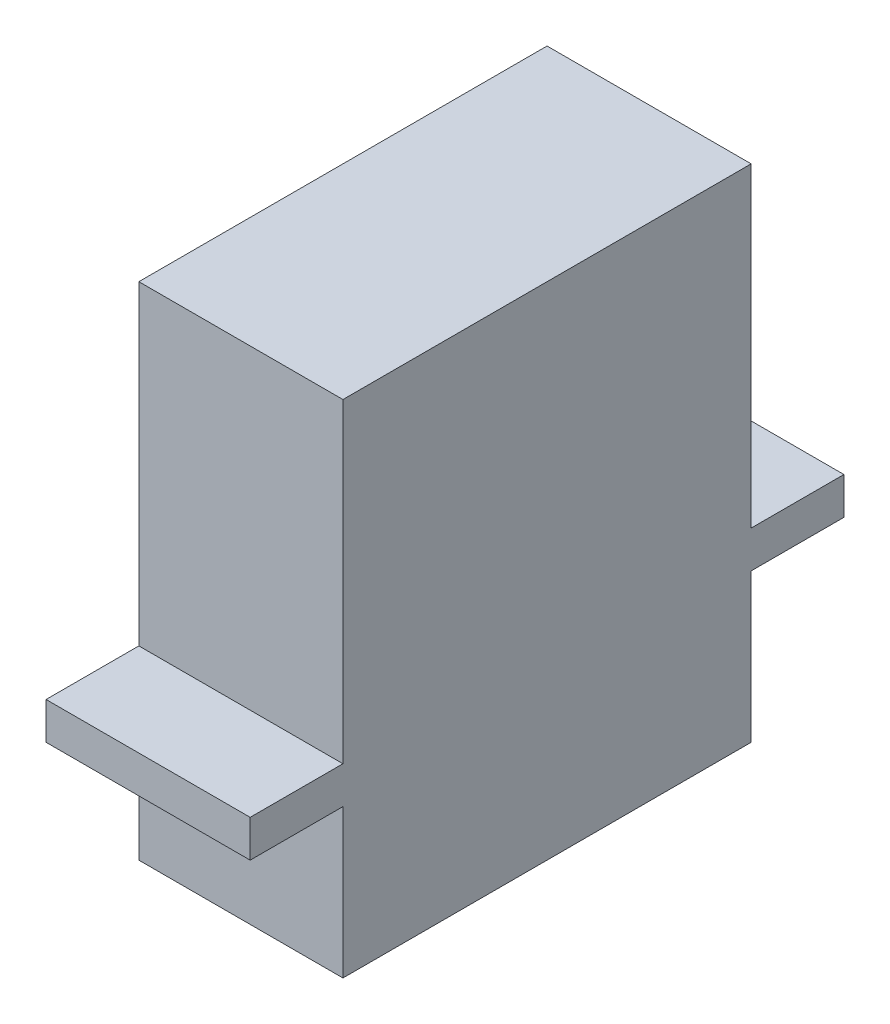
ISO-10303-21;
HEADER;
FILE_DESCRIPTION(('STEP AP214'),'2;1');
FILE_NAME('part.step','',(''),(''),'','','');
FILE_SCHEMA(('AUTOMOTIVE_DESIGN { 1 0 10303 214 1 1 1 1 }'));
ENDSEC;
DATA;
#1=APPLICATION_CONTEXT('core data for automotive mechanical design processes');
#2=APPLICATION_PROTOCOL_DEFINITION('international standard','automotive_design',2000,#1);
#3=PRODUCT_CONTEXT('',#1,'mechanical');
#4=PRODUCT('Part','Part','',(#3));
#5=PRODUCT_RELATED_PRODUCT_CATEGORY('part','',(#4));
#6=PRODUCT_DEFINITION_FORMATION('','',#4);
#7=PRODUCT_DEFINITION_CONTEXT('part definition',#1,'design');
#8=PRODUCT_DEFINITION('design','',#6,#7);
#9=PRODUCT_DEFINITION_SHAPE('','',#8);
#10=(LENGTH_UNIT() NAMED_UNIT(*) SI_UNIT(.MILLI.,.METRE.));
#11=(NAMED_UNIT(*) PLANE_ANGLE_UNIT() SI_UNIT($,.RADIAN.));
#12=(NAMED_UNIT(*) SI_UNIT($,.STERADIAN.) SOLID_ANGLE_UNIT());
#13=UNCERTAINTY_MEASURE_WITH_UNIT(LENGTH_MEASURE(1.E-05),#10,'distance_accuracy_value','');
#14=(GEOMETRIC_REPRESENTATION_CONTEXT(3) GLOBAL_UNCERTAINTY_ASSIGNED_CONTEXT((#13)) GLOBAL_UNIT_ASSIGNED_CONTEXT((#10,
#11,#12)) REPRESENTATION_CONTEXT('',''));
#15=CARTESIAN_POINT('',(0.,0.,0.));
#16=DIRECTION('',(0.,0.,1.));
#17=DIRECTION('',(1.,0.,0.));
#18=AXIS2_PLACEMENT_3D('',#15,#16,#17);
#19=CARTESIAN_POINT('',(0.,27.,-22.));
#20=DIRECTION('',(0.,0.,1.));
#21=DIRECTION('',(1.,0.,0.));
#22=AXIS2_PLACEMENT_3D('',#19,#20,#21);
#23=PLANE('',#22);
#24=DIRECTION('',(-1.,0.,0.));
#25=VECTOR('',#24,1.);
#26=CARTESIAN_POINT('',(0.,8.,-22.));
#27=LINE('',#26,#25);
#28=CARTESIAN_POINT('',(11.,8.,-22.));
#29=VERTEX_POINT('',#28);
#30=CARTESIAN_POINT('',(0.,8.,-22.));
#31=VERTEX_POINT('',#30);
#32=EDGE_CURVE('E148',#29,#31,#27,.T.);
#33=ORIENTED_EDGE('',*,*,#32,.F.);
#34=DIRECTION('',(0.,-1.,0.));
#35=VECTOR('',#34,1.);
#36=CARTESIAN_POINT('',(11.,27.,-22.));
#37=LINE('',#36,#35);
#38=CARTESIAN_POINT('',(11.,0.,-22.));
#39=VERTEX_POINT('',#38);
#40=EDGE_CURVE('E207',#29,#39,#37,.T.);
#41=ORIENTED_EDGE('',*,*,#40,.T.);
#42=DIRECTION('',(-1.,0.,0.));
#43=VECTOR('',#42,1.);
#44=CARTESIAN_POINT('',(0.,0.,-22.));
#45=LINE('',#44,#43);
#46=CARTESIAN_POINT('',(0.,0.,-22.));
#47=VERTEX_POINT('',#46);
#48=EDGE_CURVE('E190',#39,#47,#45,.T.);
#49=ORIENTED_EDGE('',*,*,#48,.T.);
#50=DIRECTION('',(0.,-1.,0.));
#51=VECTOR('',#50,1.);
#52=CARTESIAN_POINT('',(0.,27.,-22.));
#53=LINE('',#52,#51);
#54=EDGE_CURVE('E196',#31,#47,#53,.T.);
#55=ORIENTED_EDGE('',*,*,#54,.F.);
#56=EDGE_LOOP('',(#33,#41,#49,#55));
#57=FACE_BOUND('',#56,.T.);
#58=ADVANCED_FACE('F37',(#57),#23,.F.);
#59=CARTESIAN_POINT('',(0.,27.,0.));
#60=DIRECTION('',(0.,0.,-1.));
#61=DIRECTION('',(-1.,0.,0.));
#62=AXIS2_PLACEMENT_3D('',#59,#60,#61);
#63=PLANE('',#62);
#64=DIRECTION('',(1.,0.,0.));
#65=VECTOR('',#64,1.);
#66=CARTESIAN_POINT('',(0.,8.,0.));
#67=LINE('',#66,#65);
#68=CARTESIAN_POINT('',(0.,8.,0.));
#69=VERTEX_POINT('',#68);
#70=CARTESIAN_POINT('',(11.,8.,0.));
#71=VERTEX_POINT('',#70);
#72=EDGE_CURVE('E174',#69,#71,#67,.T.);
#73=ORIENTED_EDGE('',*,*,#72,.F.);
#74=DIRECTION('',(0.,-1.,0.));
#75=VECTOR('',#74,1.);
#76=CARTESIAN_POINT('',(0.,27.,0.));
#77=LINE('',#76,#75);
#78=CARTESIAN_POINT('',(0.,0.,0.));
#79=VERTEX_POINT('',#78);
#80=EDGE_CURVE('E45',#69,#79,#77,.T.);
#81=ORIENTED_EDGE('',*,*,#80,.T.);
#82=DIRECTION('',(1.,0.,0.));
#83=VECTOR('',#82,1.);
#84=CARTESIAN_POINT('',(0.,0.,0.));
#85=LINE('',#84,#83);
#86=CARTESIAN_POINT('',(11.,0.,0.));
#87=VERTEX_POINT('',#86);
#88=EDGE_CURVE('E198',#79,#87,#85,.T.);
#89=ORIENTED_EDGE('',*,*,#88,.T.);
#90=DIRECTION('',(0.,-1.,0.));
#91=VECTOR('',#90,1.);
#92=CARTESIAN_POINT('',(11.,27.,0.));
#93=LINE('',#92,#91);
#94=EDGE_CURVE('E210',#71,#87,#93,.T.);
#95=ORIENTED_EDGE('',*,*,#94,.F.);
#96=EDGE_LOOP('',(#73,#81,#89,#95));
#97=FACE_BOUND('',#96,.T.);
#98=ADVANCED_FACE('F224',(#97),#63,.F.);
#99=CARTESIAN_POINT('',(0.,27.,0.));
#100=DIRECTION('',(1.,0.,0.));
#101=DIRECTION('',(0.,0.,-1.));
#102=AXIS2_PLACEMENT_3D('',#99,#100,#101);
#103=PLANE('',#102);
#104=DIRECTION('',(0.,0.,1.));
#105=VECTOR('',#104,1.);
#106=CARTESIAN_POINT('',(0.,0.,0.));
#107=LINE('',#106,#105);
#108=EDGE_CURVE('E184',#47,#79,#107,.T.);
#109=ORIENTED_EDGE('',*,*,#108,.T.);
#110=ORIENTED_EDGE('',*,*,#80,.F.);
#111=DIRECTION('',(0.,0.,-1.));
#112=VECTOR('',#111,1.);
#113=CARTESIAN_POINT('',(0.,8.,0.));
#114=LINE('',#113,#112);
#115=CARTESIAN_POINT('',(0.,8.,5.));
#116=VERTEX_POINT('',#115);
#117=EDGE_CURVE('E160',#116,#69,#114,.T.);
#118=ORIENTED_EDGE('',*,*,#117,.F.);
#119=DIRECTION('',(0.,-1.,0.));
#120=VECTOR('',#119,1.);
#121=CARTESIAN_POINT('',(0.,10.,5.));
#122=LINE('',#121,#120);
#123=CARTESIAN_POINT('',(0.,10.,5.));
#124=VERTEX_POINT('',#123);
#125=EDGE_CURVE('E182',#124,#116,#122,.T.);
#126=ORIENTED_EDGE('',*,*,#125,.F.);
#127=DIRECTION('',(0.,0.,-1.));
#128=VECTOR('',#127,1.);
#129=CARTESIAN_POINT('',(0.,10.,0.));
#130=LINE('',#129,#128);
#131=CARTESIAN_POINT('',(0.,10.,0.));
#132=VERTEX_POINT('',#131);
#133=EDGE_CURVE('E162',#124,#132,#130,.T.);
#134=ORIENTED_EDGE('',*,*,#133,.T.);
#135=CARTESIAN_POINT('',(0.,27.,0.));
#136=VERTEX_POINT('',#135);
#137=EDGE_CURVE('E11',#136,#132,#77,.T.);
#138=ORIENTED_EDGE('',*,*,#137,.F.);
#139=DIRECTION('',(0.,0.,1.));
#140=VECTOR('',#139,1.);
#141=CARTESIAN_POINT('',(0.,27.,0.));
#142=LINE('',#141,#140);
#143=CARTESIAN_POINT('',(0.,27.,-22.));
#144=VERTEX_POINT('',#143);
#145=EDGE_CURVE('E186',#144,#136,#142,.T.);
#146=ORIENTED_EDGE('',*,*,#145,.F.);
#147=CARTESIAN_POINT('',(0.,10.,-22.));
#148=VERTEX_POINT('',#147);
#149=EDGE_CURVE('E147',#144,#148,#53,.T.);
#150=ORIENTED_EDGE('',*,*,#149,.T.);
#151=DIRECTION('',(0.,0.,-1.));
#152=VECTOR('',#151,1.);
#153=CARTESIAN_POINT('',(0.,10.,-22.));
#154=LINE('',#153,#152);
#155=CARTESIAN_POINT('',(0.,10.,-27.));
#156=VERTEX_POINT('',#155);
#157=EDGE_CURVE('E52',#148,#156,#154,.T.);
#158=ORIENTED_EDGE('',*,*,#157,.T.);
#159=DIRECTION('',(0.,-1.,0.));
#160=VECTOR('',#159,1.);
#161=CARTESIAN_POINT('',(0.,10.,-27.));
#162=LINE('',#161,#160);
#163=CARTESIAN_POINT('',(0.,8.,-27.));
#164=VERTEX_POINT('',#163);
#165=EDGE_CURVE('E129',#156,#164,#162,.T.);
#166=ORIENTED_EDGE('',*,*,#165,.T.);
#167=DIRECTION('',(0.,0.,-1.));
#168=VECTOR('',#167,1.);
#169=CARTESIAN_POINT('',(0.,8.,-22.));
#170=LINE('',#169,#168);
#171=EDGE_CURVE('E156',#31,#164,#170,.T.);
#172=ORIENTED_EDGE('',*,*,#171,.F.);
#173=ORIENTED_EDGE('',*,*,#54,.T.);
#174=EDGE_LOOP('',(#109,#110,#118,#126,#134,#138,#146,#150,#158,#166,#172,#173));
#175=FACE_BOUND('',#174,.T.);
#176=ADVANCED_FACE('F39',(#175),#103,.F.);
#177=ORIENTED_EDGE('',*,*,#137,.T.);
#178=DIRECTION('',(1.,0.,0.));
#179=VECTOR('',#178,1.);
#180=CARTESIAN_POINT('',(0.,10.,0.));
#181=LINE('',#180,#179);
#182=CARTESIAN_POINT('',(11.,10.,0.));
#183=VERTEX_POINT('',#182);
#184=EDGE_CURVE('E165',#132,#183,#181,.T.);
#185=ORIENTED_EDGE('',*,*,#184,.T.);
#186=CARTESIAN_POINT('',(11.,27.,0.));
#187=VERTEX_POINT('',#186);
#188=EDGE_CURVE('E211',#187,#183,#93,.T.);
#189=ORIENTED_EDGE('',*,*,#188,.F.);
#190=DIRECTION('',(1.,0.,0.));
#191=VECTOR('',#190,1.);
#192=CARTESIAN_POINT('',(0.,27.,0.));
#193=LINE('',#192,#191);
#194=EDGE_CURVE('E189',#136,#187,#193,.T.);
#195=ORIENTED_EDGE('',*,*,#194,.F.);
#196=EDGE_LOOP('',(#177,#185,#189,#195));
#197=FACE_BOUND('',#196,.T.);
#198=ADVANCED_FACE('F245',(#197),#63,.F.);
#199=CARTESIAN_POINT('',(11.,27.,0.));
#200=DIRECTION('',(-1.,0.,0.));
#201=DIRECTION('',(0.,0.,1.));
#202=AXIS2_PLACEMENT_3D('',#199,#200,#201);
#203=PLANE('',#202);
#204=DIRECTION('',(0.,0.,-1.));
#205=VECTOR('',#204,1.);
#206=CARTESIAN_POINT('',(11.,0.,0.));
#207=LINE('',#206,#205);
#208=EDGE_CURVE('E201',#87,#39,#207,.T.);
#209=ORIENTED_EDGE('',*,*,#208,.T.);
#210=ORIENTED_EDGE('',*,*,#40,.F.);
#211=DIRECTION('',(0.,0.,1.));
#212=VECTOR('',#211,1.);
#213=CARTESIAN_POINT('',(11.,8.,-22.));
#214=LINE('',#213,#212);
#215=CARTESIAN_POINT('',(11.,8.,-27.));
#216=VERTEX_POINT('',#215);
#217=EDGE_CURVE('E151',#216,#29,#214,.T.);
#218=ORIENTED_EDGE('',*,*,#217,.F.);
#219=DIRECTION('',(0.,-1.,0.));
#220=VECTOR('',#219,1.);
#221=CARTESIAN_POINT('',(11.,10.,-27.));
#222=LINE('',#221,#220);
#223=CARTESIAN_POINT('',(11.,10.,-27.));
#224=VERTEX_POINT('',#223);
#225=EDGE_CURVE('E136',#224,#216,#222,.T.);
#226=ORIENTED_EDGE('',*,*,#225,.F.);
#227=DIRECTION('',(0.,0.,1.));
#228=VECTOR('',#227,1.);
#229=CARTESIAN_POINT('',(11.,10.,-22.));
#230=LINE('',#229,#228);
#231=CARTESIAN_POINT('',(11.,10.,-22.));
#232=VERTEX_POINT('',#231);
#233=EDGE_CURVE('E141',#224,#232,#230,.T.);
#234=ORIENTED_EDGE('',*,*,#233,.T.);
#235=CARTESIAN_POINT('',(11.,27.,-22.));
#236=VERTEX_POINT('',#235);
#237=EDGE_CURVE('E208',#236,#232,#37,.T.);
#238=ORIENTED_EDGE('',*,*,#237,.F.);
#239=DIRECTION('',(0.,0.,-1.));
#240=VECTOR('',#239,1.);
#241=CARTESIAN_POINT('',(11.,27.,0.));
#242=LINE('',#241,#240);
#243=EDGE_CURVE('E192',#187,#236,#242,.T.);
#244=ORIENTED_EDGE('',*,*,#243,.F.);
#245=ORIENTED_EDGE('',*,*,#188,.T.);
#246=DIRECTION('',(0.,0.,1.));
#247=VECTOR('',#246,1.);
#248=CARTESIAN_POINT('',(11.,10.,0.));
#249=LINE('',#248,#247);
#250=CARTESIAN_POINT('',(11.,10.,5.));
#251=VERTEX_POINT('',#250);
#252=EDGE_CURVE('E60',#183,#251,#249,.T.);
#253=ORIENTED_EDGE('',*,*,#252,.T.);
#254=DIRECTION('',(0.,-1.,0.));
#255=VECTOR('',#254,1.);
#256=CARTESIAN_POINT('',(11.,10.,5.));
#257=LINE('',#256,#255);
#258=CARTESIAN_POINT('',(11.,8.,5.));
#259=VERTEX_POINT('',#258);
#260=EDGE_CURVE('E172',#251,#259,#257,.T.);
#261=ORIENTED_EDGE('',*,*,#260,.T.);
#262=DIRECTION('',(0.,0.,1.));
#263=VECTOR('',#262,1.);
#264=CARTESIAN_POINT('',(11.,8.,0.));
#265=LINE('',#264,#263);
#266=EDGE_CURVE('E177',#71,#259,#265,.T.);
#267=ORIENTED_EDGE('',*,*,#266,.F.);
#268=ORIENTED_EDGE('',*,*,#94,.T.);
#269=EDGE_LOOP('',(#209,#210,#218,#226,#234,#238,#244,#245,#253,#261,#267,#268));
#270=FACE_BOUND('',#269,.T.);
#271=ADVANCED_FACE('F217',(#270),#203,.F.);
#272=ORIENTED_EDGE('',*,*,#237,.T.);
#273=DIRECTION('',(-1.,0.,0.));
#274=VECTOR('',#273,1.);
#275=CARTESIAN_POINT('',(0.,10.,-22.));
#276=LINE('',#275,#274);
#277=EDGE_CURVE('E137',#232,#148,#276,.T.);
#278=ORIENTED_EDGE('',*,*,#277,.T.);
#279=ORIENTED_EDGE('',*,*,#149,.F.);
#280=DIRECTION('',(-1.,0.,0.));
#281=VECTOR('',#280,1.);
#282=CARTESIAN_POINT('',(0.,27.,-22.));
#283=LINE('',#282,#281);
#284=EDGE_CURVE('E194',#236,#144,#283,.T.);
#285=ORIENTED_EDGE('',*,*,#284,.F.);
#286=EDGE_LOOP('',(#272,#278,#279,#285));
#287=FACE_BOUND('',#286,.T.);
#288=ADVANCED_FACE('F251',(#287),#23,.F.);
#289=CARTESIAN_POINT('',(0.,27.,0.));
#290=DIRECTION('',(0.,-1.,0.));
#291=DIRECTION('',(0.,0.,-1.));
#292=AXIS2_PLACEMENT_3D('',#289,#290,#291);
#293=PLANE('',#292);
#294=ORIENTED_EDGE('',*,*,#145,.T.);
#295=ORIENTED_EDGE('',*,*,#194,.T.);
#296=ORIENTED_EDGE('',*,*,#243,.T.);
#297=ORIENTED_EDGE('',*,*,#284,.T.);
#298=EDGE_LOOP('',(#294,#295,#296,#297));
#299=FACE_BOUND('',#298,.T.);
#300=ADVANCED_FACE('F247',(#299),#293,.F.);
#301=CARTESIAN_POINT('',(0.,0.,0.));
#302=DIRECTION('',(0.,-1.,0.));
#303=DIRECTION('',(0.,0.,-1.));
#304=AXIS2_PLACEMENT_3D('',#301,#302,#303);
#305=PLANE('',#304);
#306=ORIENTED_EDGE('',*,*,#108,.F.);
#307=ORIENTED_EDGE('',*,*,#48,.F.);
#308=ORIENTED_EDGE('',*,*,#208,.F.);
#309=ORIENTED_EDGE('',*,*,#88,.F.);
#310=EDGE_LOOP('',(#306,#307,#308,#309));
#311=FACE_BOUND('',#310,.T.);
#312=ADVANCED_FACE('F228',(#311),#305,.T.);
#313=CARTESIAN_POINT('',(0.,10.,5.));
#314=DIRECTION('',(0.,0.,1.));
#315=DIRECTION('',(1.,0.,0.));
#316=AXIS2_PLACEMENT_3D('',#313,#314,#315);
#317=PLANE('',#316);
#318=DIRECTION('',(-1.,0.,0.));
#319=VECTOR('',#318,1.);
#320=CARTESIAN_POINT('',(0.,8.,5.));
#321=LINE('',#320,#319);
#322=EDGE_CURVE('E166',#259,#116,#321,.T.);
#323=ORIENTED_EDGE('',*,*,#322,.F.);
#324=ORIENTED_EDGE('',*,*,#260,.F.);
#325=DIRECTION('',(-1.,0.,0.));
#326=VECTOR('',#325,1.);
#327=CARTESIAN_POINT('',(0.,10.,5.));
#328=LINE('',#327,#326);
#329=EDGE_CURVE('E169',#251,#124,#328,.T.);
#330=ORIENTED_EDGE('',*,*,#329,.T.);
#331=ORIENTED_EDGE('',*,*,#125,.T.);
#332=EDGE_LOOP('',(#323,#324,#330,#331));
#333=FACE_BOUND('',#332,.T.);
#334=ADVANCED_FACE('F241',(#333),#317,.T.);
#335=CARTESIAN_POINT('',(0.,10.,0.));
#336=DIRECTION('',(0.,1.,0.));
#337=DIRECTION('',(0.,0.,1.));
#338=AXIS2_PLACEMENT_3D('',#335,#336,#337);
#339=PLANE('',#338);
#340=ORIENTED_EDGE('',*,*,#133,.F.);
#341=ORIENTED_EDGE('',*,*,#329,.F.);
#342=ORIENTED_EDGE('',*,*,#252,.F.);
#343=ORIENTED_EDGE('',*,*,#184,.F.);
#344=EDGE_LOOP('',(#340,#341,#342,#343));
#345=FACE_BOUND('',#344,.T.);
#346=ADVANCED_FACE('F242',(#345),#339,.T.);
#347=CARTESIAN_POINT('',(0.,8.,0.));
#348=DIRECTION('',(0.,1.,0.));
#349=DIRECTION('',(0.,0.,1.));
#350=AXIS2_PLACEMENT_3D('',#347,#348,#349);
#351=PLANE('',#350);
#352=ORIENTED_EDGE('',*,*,#117,.T.);
#353=ORIENTED_EDGE('',*,*,#72,.T.);
#354=ORIENTED_EDGE('',*,*,#266,.T.);
#355=ORIENTED_EDGE('',*,*,#322,.T.);
#356=EDGE_LOOP('',(#352,#353,#354,#355));
#357=FACE_BOUND('',#356,.T.);
#358=ADVANCED_FACE('F239',(#357),#351,.F.);
#359=CARTESIAN_POINT('',(0.,10.,-27.));
#360=DIRECTION('',(0.,0.,-1.));
#361=DIRECTION('',(-1.,0.,0.));
#362=AXIS2_PLACEMENT_3D('',#359,#360,#361);
#363=PLANE('',#362);
#364=DIRECTION('',(1.,0.,0.));
#365=VECTOR('',#364,1.);
#366=CARTESIAN_POINT('',(0.,8.,-27.));
#367=LINE('',#366,#365);
#368=EDGE_CURVE('E133',#164,#216,#367,.T.);
#369=ORIENTED_EDGE('',*,*,#368,.F.);
#370=ORIENTED_EDGE('',*,*,#165,.F.);
#371=DIRECTION('',(1.,0.,0.));
#372=VECTOR('',#371,1.);
#373=CARTESIAN_POINT('',(0.,10.,-27.));
#374=LINE('',#373,#372);
#375=EDGE_CURVE('E131',#156,#224,#374,.T.);
#376=ORIENTED_EDGE('',*,*,#375,.T.);
#377=ORIENTED_EDGE('',*,*,#225,.T.);
#378=EDGE_LOOP('',(#369,#370,#376,#377));
#379=FACE_BOUND('',#378,.T.);
#380=ADVANCED_FACE('F130',(#379),#363,.T.);
#381=CARTESIAN_POINT('',(0.,10.,0.));
#382=DIRECTION('',(0.,-1.,0.));
#383=DIRECTION('',(0.,0.,-1.));
#384=AXIS2_PLACEMENT_3D('',#381,#382,#383);
#385=PLANE('',#384);
#386=ORIENTED_EDGE('',*,*,#157,.F.);
#387=ORIENTED_EDGE('',*,*,#277,.F.);
#388=ORIENTED_EDGE('',*,*,#233,.F.);
#389=ORIENTED_EDGE('',*,*,#375,.F.);
#390=EDGE_LOOP('',(#386,#387,#388,#389));
#391=FACE_BOUND('',#390,.T.);
#392=ADVANCED_FACE('F140',(#391),#385,.F.);
#393=CARTESIAN_POINT('',(0.,8.,0.));
#394=DIRECTION('',(0.,-1.,0.));
#395=DIRECTION('',(0.,0.,-1.));
#396=AXIS2_PLACEMENT_3D('',#393,#394,#395);
#397=PLANE('',#396);
#398=ORIENTED_EDGE('',*,*,#171,.T.);
#399=ORIENTED_EDGE('',*,*,#368,.T.);
#400=ORIENTED_EDGE('',*,*,#217,.T.);
#401=ORIENTED_EDGE('',*,*,#32,.T.);
#402=EDGE_LOOP('',(#398,#399,#400,#401));
#403=FACE_BOUND('',#402,.T.);
#404=ADVANCED_FACE('F234',(#403),#397,.T.);
#405=CLOSED_SHELL('',(#58,#98,#176,#198,#271,#288,#300,#312,#334,#346,#358,#380,#392,#404));
#406=MANIFOLD_SOLID_BREP('B2',#405);
#407=ADVANCED_BREP_SHAPE_REPRESENTATION('',(#18,#406),#14);
#408=SHAPE_DEFINITION_REPRESENTATION(#9,#407);
ENDSEC;
END-ISO-10303-21;
